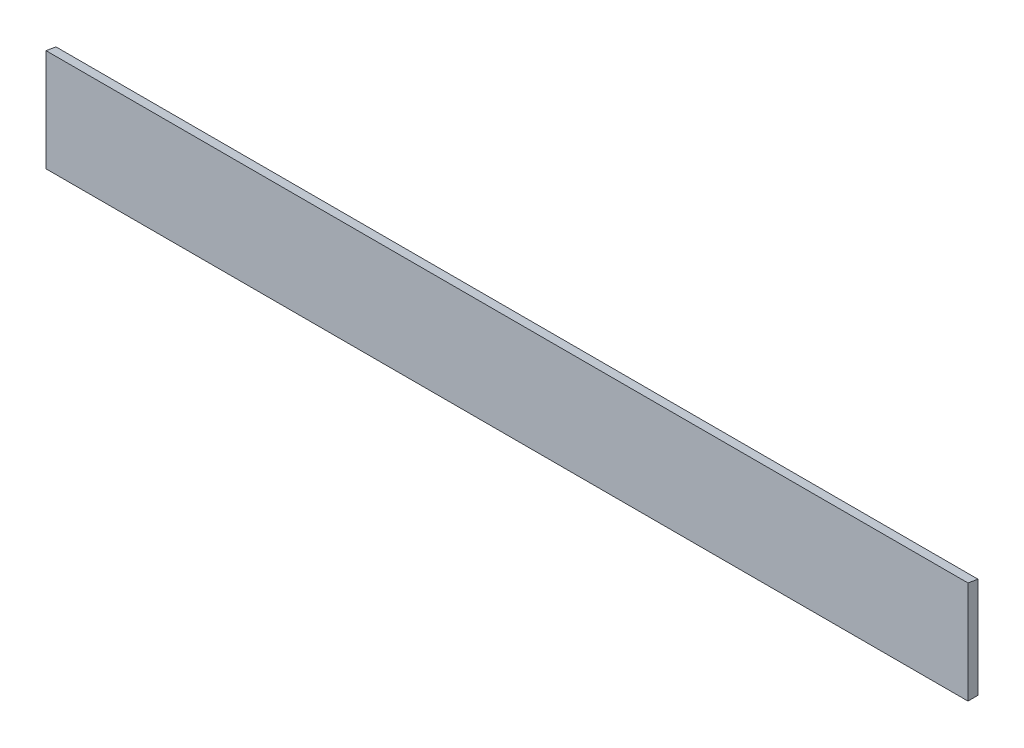
ISO-10303-21;
HEADER;
FILE_DESCRIPTION(('STEP AP214'),'2;1');
FILE_NAME('part.step','',(''),(''),'','','');
FILE_SCHEMA(('AUTOMOTIVE_DESIGN { 1 0 10303 214 1 1 1 1 }'));
ENDSEC;
DATA;
#1=APPLICATION_CONTEXT('core data for automotive mechanical design processes');
#2=APPLICATION_PROTOCOL_DEFINITION('international standard','automotive_design',2000,#1);
#3=PRODUCT_CONTEXT('',#1,'mechanical');
#4=PRODUCT('Part','Part','',(#3));
#5=PRODUCT_RELATED_PRODUCT_CATEGORY('part','',(#4));
#6=PRODUCT_DEFINITION_FORMATION('','',#4);
#7=PRODUCT_DEFINITION_CONTEXT('part definition',#1,'design');
#8=PRODUCT_DEFINITION('design','',#6,#7);
#9=PRODUCT_DEFINITION_SHAPE('','',#8);
#10=(LENGTH_UNIT() NAMED_UNIT(*) SI_UNIT(.MILLI.,.METRE.));
#11=(NAMED_UNIT(*) PLANE_ANGLE_UNIT() SI_UNIT($,.RADIAN.));
#12=(NAMED_UNIT(*) SI_UNIT($,.STERADIAN.) SOLID_ANGLE_UNIT());
#13=UNCERTAINTY_MEASURE_WITH_UNIT(LENGTH_MEASURE(1.E-05),#10,'distance_accuracy_value','');
#14=(GEOMETRIC_REPRESENTATION_CONTEXT(3) GLOBAL_UNCERTAINTY_ASSIGNED_CONTEXT((#13)) GLOBAL_UNIT_ASSIGNED_CONTEXT((#10,
#11,#12)) REPRESENTATION_CONTEXT('',''));
#15=CARTESIAN_POINT('',(0.,0.,0.));
#16=DIRECTION('',(0.,0.,1.));
#17=DIRECTION('',(1.,0.,0.));
#18=AXIS2_PLACEMENT_3D('',#15,#16,#17);
#19=CARTESIAN_POINT('',(325.097708047474,61.0195881750477,-291.501088248647));
#20=DIRECTION('',(0.,0.,-1.));
#21=DIRECTION('',(-1.,0.,0.));
#22=AXIS2_PLACEMENT_3D('',#19,#20,#21);
#23=PLANE('',#22);
#24=DIRECTION('',(0.,1.,0.));
#25=VECTOR('',#24,1.);
#26=CARTESIAN_POINT('',(666.894917120642,85.3157017452683,-291.501088248647));
#27=LINE('',#26,#25);
#28=CARTESIAN_POINT('',(666.894917120642,55.3157017452683,-291.501088248647));
#29=VERTEX_POINT('',#28);
#30=CARTESIAN_POINT('',(666.894917120642,85.3157017452683,-291.501088248647));
#31=VERTEX_POINT('',#30);
#32=EDGE_CURVE('E53',#29,#31,#27,.T.);
#33=ORIENTED_EDGE('',*,*,#32,.F.);
#34=DIRECTION('',(1.,0.,0.));
#35=VECTOR('',#34,1.);
#36=CARTESIAN_POINT('',(666.894917120642,55.3157017452683,-291.501088248647));
#37=LINE('',#36,#35);
#38=CARTESIAN_POINT('',(391.894917120642,55.3157017452683,-291.501088248647));
#39=VERTEX_POINT('',#38);
#40=EDGE_CURVE('E68',#39,#29,#37,.T.);
#41=ORIENTED_EDGE('',*,*,#40,.F.);
#42=DIRECTION('',(0.,1.,0.));
#43=VECTOR('',#42,1.);
#44=CARTESIAN_POINT('',(391.894917120642,55.3157017452683,-291.501088248647));
#45=LINE('',#44,#43);
#46=CARTESIAN_POINT('',(391.894917120642,85.3157017452683,-291.501088248647));
#47=VERTEX_POINT('',#46);
#48=EDGE_CURVE('E20',#47,#39,#45,.F.);
#49=ORIENTED_EDGE('',*,*,#48,.F.);
#50=DIRECTION('',(1.,0.,0.));
#51=VECTOR('',#50,1.);
#52=CARTESIAN_POINT('',(391.894917120642,85.3157017452683,-291.501088248647));
#53=LINE('',#52,#51);
#54=EDGE_CURVE('E58',#31,#47,#53,.F.);
#55=ORIENTED_EDGE('',*,*,#54,.F.);
#56=EDGE_LOOP('',(#33,#41,#49,#55));
#57=FACE_BOUND('',#56,.T.);
#58=ADVANCED_FACE('F17',(#57),#23,.T.);
#59=CARTESIAN_POINT('',(391.894917120642,55.3157017452683,-291.501088248647));
#60=DIRECTION('',(-1.,0.,0.));
#61=DIRECTION('',(0.,0.,1.));
#62=AXIS2_PLACEMENT_3D('',#59,#60,#61);
#63=PLANE('',#62);
#64=DIRECTION('',(0.,1.,0.));
#65=VECTOR('',#64,1.);
#66=CARTESIAN_POINT('',(391.894917120642,61.0195881750477,-288.501088248647));
#67=LINE('',#66,#65);
#68=CARTESIAN_POINT('',(391.894917120642,55.3157017452683,-288.501088248647));
#69=VERTEX_POINT('',#68);
#70=CARTESIAN_POINT('',(391.894917120642,85.8446826873937,-288.501088248647));
#71=VERTEX_POINT('',#70);
#72=EDGE_CURVE('E74',#69,#71,#67,.T.);
#73=ORIENTED_EDGE('',*,*,#72,.T.);
#74=DIRECTION('',(0.,0.17364817766693,0.984807753012208));
#75=VECTOR('',#74,1.);
#76=CARTESIAN_POINT('',(391.894917120642,85.3157017452683,-291.501088248647));
#77=LINE('',#76,#75);
#78=EDGE_CURVE('E63',#47,#71,#77,.T.);
#79=ORIENTED_EDGE('',*,*,#78,.F.);
#80=ORIENTED_EDGE('',*,*,#48,.T.);
#81=DIRECTION('',(0.,0.,-1.));
#82=VECTOR('',#81,1.);
#83=CARTESIAN_POINT('',(391.894917120642,55.3157017452683,-291.501088248647));
#84=LINE('',#83,#82);
#85=EDGE_CURVE('E81',#69,#39,#84,.T.);
#86=ORIENTED_EDGE('',*,*,#85,.F.);
#87=EDGE_LOOP('',(#73,#79,#80,#86));
#88=FACE_BOUND('',#87,.T.);
#89=ADVANCED_FACE('F73',(#88),#63,.T.);
#90=CARTESIAN_POINT('',(391.894917120642,85.3157017452683,-291.501088248647));
#91=DIRECTION('',(0.,0.984807753012208,-0.17364817766693));
#92=DIRECTION('',(0.,0.17364817766693,0.984807753012208));
#93=AXIS2_PLACEMENT_3D('',#90,#91,#92);
#94=PLANE('',#93);
#95=DIRECTION('',(-1.,0.,0.));
#96=VECTOR('',#95,1.);
#97=CARTESIAN_POINT('',(325.097708047474,85.8446826873937,-288.501088248647));
#98=LINE('',#97,#96);
#99=CARTESIAN_POINT('',(666.894917120642,85.8446826873937,-288.501088248647));
#100=VERTEX_POINT('',#99);
#101=EDGE_CURVE('E84',#71,#100,#98,.F.);
#102=ORIENTED_EDGE('',*,*,#101,.T.);
#103=DIRECTION('',(0.,0.173648177666933,0.984807753012208));
#104=VECTOR('',#103,1.);
#105=CARTESIAN_POINT('',(666.894917120642,85.3157017452683,-291.501088248647));
#106=LINE('',#105,#104);
#107=EDGE_CURVE('E65',#31,#100,#106,.T.);
#108=ORIENTED_EDGE('',*,*,#107,.F.);
#109=ORIENTED_EDGE('',*,*,#54,.T.);
#110=ORIENTED_EDGE('',*,*,#78,.T.);
#111=EDGE_LOOP('',(#102,#108,#109,#110));
#112=FACE_BOUND('',#111,.T.);
#113=ADVANCED_FACE('F61',(#112),#94,.T.);
#114=CARTESIAN_POINT('',(666.894917120642,85.3157017452683,-291.501088248647));
#115=DIRECTION('',(1.,0.,0.));
#116=DIRECTION('',(0.,0.,-1.));
#117=AXIS2_PLACEMENT_3D('',#114,#115,#116);
#118=PLANE('',#117);
#119=DIRECTION('',(0.,1.,0.));
#120=VECTOR('',#119,1.);
#121=CARTESIAN_POINT('',(666.894917120642,61.0195881750477,-288.501088248647));
#122=LINE('',#121,#120);
#123=CARTESIAN_POINT('',(666.894917120642,55.3157017452683,-288.501088248647));
#124=VERTEX_POINT('',#123);
#125=EDGE_CURVE('E26',#100,#124,#122,.F.);
#126=ORIENTED_EDGE('',*,*,#125,.T.);
#127=DIRECTION('',(0.,0.,-1.));
#128=VECTOR('',#127,1.);
#129=CARTESIAN_POINT('',(666.894917120642,55.3157017452683,-291.501088248647));
#130=LINE('',#129,#128);
#131=EDGE_CURVE('E34',#29,#124,#130,.F.);
#132=ORIENTED_EDGE('',*,*,#131,.F.);
#133=ORIENTED_EDGE('',*,*,#32,.T.);
#134=ORIENTED_EDGE('',*,*,#107,.T.);
#135=EDGE_LOOP('',(#126,#132,#133,#134));
#136=FACE_BOUND('',#135,.T.);
#137=ADVANCED_FACE('F88',(#136),#118,.T.);
#138=CARTESIAN_POINT('',(666.894917120642,55.3157017452683,-291.501088248647));
#139=DIRECTION('',(0.,-1.,0.));
#140=DIRECTION('',(0.,0.,-1.));
#141=AXIS2_PLACEMENT_3D('',#138,#139,#140);
#142=PLANE('',#141);
#143=DIRECTION('',(-1.,0.,0.));
#144=VECTOR('',#143,1.);
#145=CARTESIAN_POINT('',(325.097708047474,55.3157017452683,-288.501088248647));
#146=LINE('',#145,#144);
#147=EDGE_CURVE('E11',#124,#69,#146,.T.);
#148=ORIENTED_EDGE('',*,*,#147,.T.);
#149=ORIENTED_EDGE('',*,*,#85,.T.);
#150=ORIENTED_EDGE('',*,*,#40,.T.);
#151=ORIENTED_EDGE('',*,*,#131,.T.);
#152=EDGE_LOOP('',(#148,#149,#150,#151));
#153=FACE_BOUND('',#152,.T.);
#154=ADVANCED_FACE('F91',(#153),#142,.T.);
#155=CARTESIAN_POINT('',(325.097708047474,61.0195881750477,-288.501088248647));
#156=DIRECTION('',(0.,0.,-1.));
#157=DIRECTION('',(-1.,0.,0.));
#158=AXIS2_PLACEMENT_3D('',#155,#156,#157);
#159=PLANE('',#158);
#160=ORIENTED_EDGE('',*,*,#125,.F.);
#161=ORIENTED_EDGE('',*,*,#101,.F.);
#162=ORIENTED_EDGE('',*,*,#72,.F.);
#163=ORIENTED_EDGE('',*,*,#147,.F.);
#164=EDGE_LOOP('',(#160,#161,#162,#163));
#165=FACE_BOUND('',#164,.T.);
#166=ADVANCED_FACE('F90',(#165),#159,.F.);
#167=CLOSED_SHELL('',(#58,#89,#113,#137,#154,#166));
#168=MANIFOLD_SOLID_BREP('B1',#167);
#169=ADVANCED_BREP_SHAPE_REPRESENTATION('',(#18,#168),#14);
#170=SHAPE_DEFINITION_REPRESENTATION(#9,#169);
ENDSEC;
END-ISO-10303-21;
